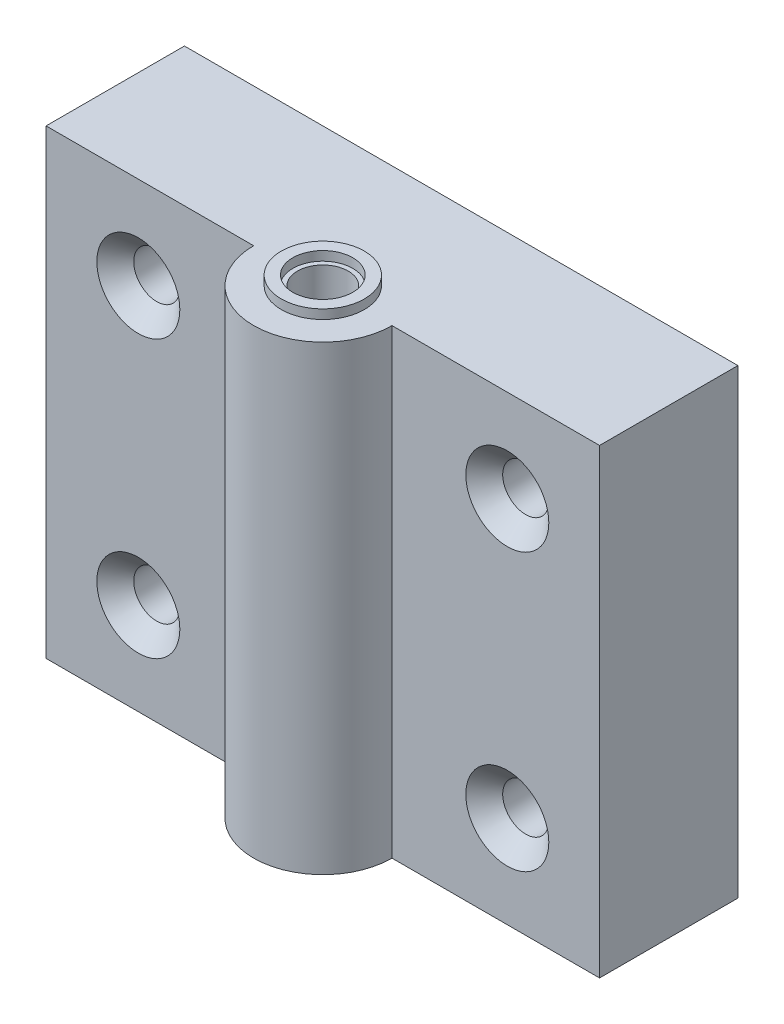
ISO-10303-21;
HEADER;
FILE_DESCRIPTION(('STEP AP214'),'2;1');
FILE_NAME('part.step','',(''),(''),'','','');
FILE_SCHEMA(('AUTOMOTIVE_DESIGN { 1 0 10303 214 1 1 1 1 }'));
ENDSEC;
DATA;
#1=APPLICATION_CONTEXT('core data for automotive mechanical design processes');
#2=APPLICATION_PROTOCOL_DEFINITION('international standard','automotive_design',2000,#1);
#3=PRODUCT_CONTEXT('',#1,'mechanical');
#4=PRODUCT('Part','Part','',(#3));
#5=PRODUCT_RELATED_PRODUCT_CATEGORY('part','',(#4));
#6=PRODUCT_DEFINITION_FORMATION('','',#4);
#7=PRODUCT_DEFINITION_CONTEXT('part definition',#1,'design');
#8=PRODUCT_DEFINITION('design','',#6,#7);
#9=PRODUCT_DEFINITION_SHAPE('','',#8);
#10=(LENGTH_UNIT() NAMED_UNIT(*) SI_UNIT(.MILLI.,.METRE.));
#11=(NAMED_UNIT(*) PLANE_ANGLE_UNIT() SI_UNIT($,.RADIAN.));
#12=(NAMED_UNIT(*) SI_UNIT($,.STERADIAN.) SOLID_ANGLE_UNIT());
#13=UNCERTAINTY_MEASURE_WITH_UNIT(LENGTH_MEASURE(1.E-05),#10,'distance_accuracy_value','');
#14=(GEOMETRIC_REPRESENTATION_CONTEXT(3) GLOBAL_UNCERTAINTY_ASSIGNED_CONTEXT((#13)) GLOBAL_UNIT_ASSIGNED_CONTEXT((#10,
#11,#12)) REPRESENTATION_CONTEXT('',''));
#15=CARTESIAN_POINT('',(0.,0.,0.));
#16=DIRECTION('',(0.,0.,1.));
#17=DIRECTION('',(1.,0.,0.));
#18=AXIS2_PLACEMENT_3D('',#15,#16,#17);
#19=CARTESIAN_POINT('',(0.,0.,15.));
#20=DIRECTION('',(0.,0.,1.));
#21=DIRECTION('',(1.,0.,0.));
#22=AXIS2_PLACEMENT_3D('',#19,#20,#21);
#23=PLANE('',#22);
#24=CARTESIAN_POINT('',(20.,15.,15.));
#25=DIRECTION('',(0.,0.,1.));
#26=DIRECTION('',(1.,0.,0.));
#27=AXIS2_PLACEMENT_3D('',#24,#25,#26);
#28=CIRCLE('',#27,4.5);
#29=CARTESIAN_POINT('',(24.5,15.,15.));
#30=VERTEX_POINT('',#29);
#31=EDGE_CURVE('E375',#30,#30,#28,.T.);
#32=ORIENTED_EDGE('',*,*,#31,.F.);
#33=EDGE_LOOP('',(#32));
#34=FACE_BOUND('',#33,.T.);
#35=CARTESIAN_POINT('',(20.,-15.,15.));
#36=DIRECTION('',(0.,0.,1.));
#37=DIRECTION('',(1.,0.,0.));
#38=AXIS2_PLACEMENT_3D('',#35,#36,#37);
#39=CIRCLE('',#38,4.5);
#40=CARTESIAN_POINT('',(24.5,-15.,15.));
#41=VERTEX_POINT('',#40);
#42=EDGE_CURVE('E377',#41,#41,#39,.T.);
#43=ORIENTED_EDGE('',*,*,#42,.F.);
#44=EDGE_LOOP('',(#43));
#45=FACE_BOUND('',#44,.T.);
#46=DIRECTION('',(0.,1.,0.));
#47=VECTOR('',#46,1.);
#48=CARTESIAN_POINT('',(7.5,-25.,15.));
#49=LINE('',#48,#47);
#50=CARTESIAN_POINT('',(7.5,-25.,15.));
#51=VERTEX_POINT('',#50);
#52=CARTESIAN_POINT('',(7.5,25.,15.));
#53=VERTEX_POINT('',#52);
#54=EDGE_CURVE('E50',#51,#53,#49,.T.);
#55=ORIENTED_EDGE('',*,*,#54,.F.);
#56=DIRECTION('',(1.,0.,0.));
#57=VECTOR('',#56,1.);
#58=CARTESIAN_POINT('',(-30.,-25.,15.));
#59=LINE('',#58,#57);
#60=CARTESIAN_POINT('',(30.,-25.,15.));
#61=VERTEX_POINT('',#60);
#62=EDGE_CURVE('E121',#51,#61,#59,.T.);
#63=ORIENTED_EDGE('',*,*,#62,.T.);
#64=DIRECTION('',(0.,1.,0.));
#65=VECTOR('',#64,1.);
#66=CARTESIAN_POINT('',(30.,25.,15.));
#67=LINE('',#66,#65);
#68=CARTESIAN_POINT('',(30.,25.,15.));
#69=VERTEX_POINT('',#68);
#70=EDGE_CURVE('E97',#61,#69,#67,.T.);
#71=ORIENTED_EDGE('',*,*,#70,.T.);
#72=DIRECTION('',(-1.,0.,0.));
#73=VECTOR('',#72,1.);
#74=CARTESIAN_POINT('',(-30.,25.,15.));
#75=LINE('',#74,#73);
#76=EDGE_CURVE('E96',#69,#53,#75,.T.);
#77=ORIENTED_EDGE('',*,*,#76,.T.);
#78=EDGE_LOOP('',(#55,#63,#71,#77));
#79=FACE_BOUND('',#78,.T.);
#80=ADVANCED_FACE('F35',(#34,#45,#79),#23,.T.);
#81=CARTESIAN_POINT('',(30.,25.,15.));
#82=DIRECTION('',(-1.,0.,0.));
#83=DIRECTION('',(0.,-1.,0.));
#84=AXIS2_PLACEMENT_3D('',#81,#82,#83);
#85=PLANE('',#84);
#86=DIRECTION('',(0.,1.,0.));
#87=VECTOR('',#86,1.);
#88=CARTESIAN_POINT('',(30.,25.,0.));
#89=LINE('',#88,#87);
#90=CARTESIAN_POINT('',(30.,-25.,0.));
#91=VERTEX_POINT('',#90);
#92=CARTESIAN_POINT('',(30.,25.,0.));
#93=VERTEX_POINT('',#92);
#94=EDGE_CURVE('E104',#91,#93,#89,.T.);
#95=ORIENTED_EDGE('',*,*,#94,.T.);
#96=DIRECTION('',(0.,0.,-1.));
#97=VECTOR('',#96,1.);
#98=CARTESIAN_POINT('',(30.,25.,15.));
#99=LINE('',#98,#97);
#100=EDGE_CURVE('E43',#69,#93,#99,.T.);
#101=ORIENTED_EDGE('',*,*,#100,.F.);
#102=ORIENTED_EDGE('',*,*,#70,.F.);
#103=DIRECTION('',(0.,0.,-1.));
#104=VECTOR('',#103,1.);
#105=CARTESIAN_POINT('',(30.,-25.,15.));
#106=LINE('',#105,#104);
#107=EDGE_CURVE('E123',#61,#91,#106,.T.);
#108=ORIENTED_EDGE('',*,*,#107,.T.);
#109=EDGE_LOOP('',(#95,#101,#102,#108));
#110=FACE_BOUND('',#109,.T.);
#111=ADVANCED_FACE('F37',(#110),#85,.F.);
#112=CARTESIAN_POINT('',(-30.,25.,15.));
#113=DIRECTION('',(0.,-1.,0.));
#114=DIRECTION('',(0.,0.,-1.));
#115=AXIS2_PLACEMENT_3D('',#112,#113,#114);
#116=PLANE('',#115);
#117=CARTESIAN_POINT('',(0.,25.,15.));
#118=DIRECTION('',(0.,-1.,0.));
#119=DIRECTION('',(0.,0.,-1.));
#120=AXIS2_PLACEMENT_3D('',#117,#118,#119);
#121=CIRCLE('',#120,4.5);
#122=CARTESIAN_POINT('',(0.,25.,10.5));
#123=VERTEX_POINT('',#122);
#124=EDGE_CURVE('E11',#123,#123,#121,.F.);
#125=ORIENTED_EDGE('',*,*,#124,.F.);
#126=EDGE_LOOP('',(#125));
#127=FACE_BOUND('',#126,.T.);
#128=DIRECTION('',(-1.,0.,0.));
#129=VECTOR('',#128,1.);
#130=CARTESIAN_POINT('',(-30.,25.,0.));
#131=LINE('',#130,#129);
#132=CARTESIAN_POINT('',(-30.,25.,0.));
#133=VERTEX_POINT('',#132);
#134=EDGE_CURVE('E126',#93,#133,#131,.T.);
#135=ORIENTED_EDGE('',*,*,#134,.T.);
#136=DIRECTION('',(0.,0.,-1.));
#137=VECTOR('',#136,1.);
#138=CARTESIAN_POINT('',(-30.,25.,15.));
#139=LINE('',#138,#137);
#140=CARTESIAN_POINT('',(-30.,25.,15.));
#141=VERTEX_POINT('',#140);
#142=EDGE_CURVE('E94',#141,#133,#139,.T.);
#143=ORIENTED_EDGE('',*,*,#142,.F.);
#144=CARTESIAN_POINT('',(-7.5,25.,15.));
#145=VERTEX_POINT('',#144);
#146=EDGE_CURVE('E89',#145,#141,#75,.T.);
#147=ORIENTED_EDGE('',*,*,#146,.F.);
#148=CARTESIAN_POINT('',(0.,25.,15.));
#149=DIRECTION('',(0.,1.,0.));
#150=DIRECTION('',(0.,0.,1.));
#151=AXIS2_PLACEMENT_3D('',#148,#149,#150);
#152=CIRCLE('',#151,7.5);
#153=EDGE_CURVE('E92',#145,#53,#152,.T.);
#154=ORIENTED_EDGE('',*,*,#153,.T.);
#155=ORIENTED_EDGE('',*,*,#76,.F.);
#156=ORIENTED_EDGE('',*,*,#100,.T.);
#157=EDGE_LOOP('',(#135,#143,#147,#154,#155,#156));
#158=FACE_BOUND('',#157,.T.);
#159=ADVANCED_FACE('F90',(#127,#158),#116,.F.);
#160=CARTESIAN_POINT('',(-30.,25.,15.));
#161=DIRECTION('',(1.,0.,0.));
#162=DIRECTION('',(0.,1.,0.));
#163=AXIS2_PLACEMENT_3D('',#160,#161,#162);
#164=PLANE('',#163);
#165=DIRECTION('',(0.,-1.,0.));
#166=VECTOR('',#165,1.);
#167=CARTESIAN_POINT('',(-30.,25.,0.));
#168=LINE('',#167,#166);
#169=CARTESIAN_POINT('',(-30.,-25.,0.));
#170=VERTEX_POINT('',#169);
#171=EDGE_CURVE('E128',#133,#170,#168,.T.);
#172=ORIENTED_EDGE('',*,*,#171,.T.);
#173=DIRECTION('',(0.,0.,-1.));
#174=VECTOR('',#173,1.);
#175=CARTESIAN_POINT('',(-30.,-25.,15.));
#176=LINE('',#175,#174);
#177=CARTESIAN_POINT('',(-30.,-25.,15.));
#178=VERTEX_POINT('',#177);
#179=EDGE_CURVE('E133',#178,#170,#176,.T.);
#180=ORIENTED_EDGE('',*,*,#179,.F.);
#181=DIRECTION('',(0.,-1.,0.));
#182=VECTOR('',#181,1.);
#183=CARTESIAN_POINT('',(-30.,25.,15.));
#184=LINE('',#183,#182);
#185=EDGE_CURVE('E119',#141,#178,#184,.T.);
#186=ORIENTED_EDGE('',*,*,#185,.F.);
#187=ORIENTED_EDGE('',*,*,#142,.T.);
#188=EDGE_LOOP('',(#172,#180,#186,#187));
#189=FACE_BOUND('',#188,.T.);
#190=ADVANCED_FACE('F148',(#189),#164,.F.);
#191=CARTESIAN_POINT('',(-30.,-25.,15.));
#192=DIRECTION('',(0.,1.,0.));
#193=DIRECTION('',(0.,0.,1.));
#194=AXIS2_PLACEMENT_3D('',#191,#192,#193);
#195=PLANE('',#194);
#196=CARTESIAN_POINT('',(0.,-25.,15.));
#197=DIRECTION('',(0.,1.,0.));
#198=DIRECTION('',(0.,0.,1.));
#199=AXIS2_PLACEMENT_3D('',#196,#197,#198);
#200=CIRCLE('',#199,2.75);
#201=CARTESIAN_POINT('',(0.,-25.,17.75));
#202=VERTEX_POINT('',#201);
#203=EDGE_CURVE('E200',#202,#202,#200,.T.);
#204=ORIENTED_EDGE('',*,*,#203,.T.);
#205=EDGE_LOOP('',(#204));
#206=FACE_BOUND('',#205,.T.);
#207=DIRECTION('',(1.,0.,0.));
#208=VECTOR('',#207,1.);
#209=CARTESIAN_POINT('',(-30.,-25.,0.));
#210=LINE('',#209,#208);
#211=EDGE_CURVE('E117',#170,#91,#210,.T.);
#212=ORIENTED_EDGE('',*,*,#211,.T.);
#213=ORIENTED_EDGE('',*,*,#107,.F.);
#214=ORIENTED_EDGE('',*,*,#62,.F.);
#215=CARTESIAN_POINT('',(0.,-25.,15.));
#216=DIRECTION('',(0.,1.,0.));
#217=DIRECTION('',(0.,0.,1.));
#218=AXIS2_PLACEMENT_3D('',#215,#216,#217);
#219=CIRCLE('',#218,7.5);
#220=CARTESIAN_POINT('',(-7.5,-25.,15.));
#221=VERTEX_POINT('',#220);
#222=EDGE_CURVE('E107',#221,#51,#219,.T.);
#223=ORIENTED_EDGE('',*,*,#222,.F.);
#224=EDGE_CURVE('E58',#178,#221,#59,.T.);
#225=ORIENTED_EDGE('',*,*,#224,.F.);
#226=ORIENTED_EDGE('',*,*,#179,.T.);
#227=EDGE_LOOP('',(#212,#213,#214,#223,#225,#226));
#228=FACE_BOUND('',#227,.T.);
#229=ADVANCED_FACE('F150',(#206,#228),#195,.F.);
#230=CARTESIAN_POINT('',(-20.,15.,15.));
#231=DIRECTION('',(0.,0.,1.));
#232=DIRECTION('',(1.,0.,0.));
#233=AXIS2_PLACEMENT_3D('',#230,#231,#232);
#234=CIRCLE('',#233,4.5);
#235=CARTESIAN_POINT('',(-15.5,15.,15.));
#236=VERTEX_POINT('',#235);
#237=EDGE_CURVE('E173',#236,#236,#234,.T.);
#238=ORIENTED_EDGE('',*,*,#237,.F.);
#239=EDGE_LOOP('',(#238));
#240=FACE_BOUND('',#239,.T.);
#241=CARTESIAN_POINT('',(-20.,-15.,15.));
#242=DIRECTION('',(0.,0.,1.));
#243=DIRECTION('',(1.,0.,0.));
#244=AXIS2_PLACEMENT_3D('',#241,#242,#243);
#245=CIRCLE('',#244,4.5);
#246=CARTESIAN_POINT('',(-15.5,-15.,15.));
#247=VERTEX_POINT('',#246);
#248=EDGE_CURVE('E176',#247,#247,#245,.T.);
#249=ORIENTED_EDGE('',*,*,#248,.F.);
#250=EDGE_LOOP('',(#249));
#251=FACE_BOUND('',#250,.T.);
#252=DIRECTION('',(0.,1.,0.));
#253=VECTOR('',#252,1.);
#254=CARTESIAN_POINT('',(-7.5,-25.,15.));
#255=LINE('',#254,#253);
#256=EDGE_CURVE('E99',#221,#145,#255,.T.);
#257=ORIENTED_EDGE('',*,*,#256,.T.);
#258=ORIENTED_EDGE('',*,*,#146,.T.);
#259=ORIENTED_EDGE('',*,*,#185,.T.);
#260=ORIENTED_EDGE('',*,*,#224,.T.);
#261=EDGE_LOOP('',(#257,#258,#259,#260));
#262=FACE_BOUND('',#261,.T.);
#263=ADVANCED_FACE('F100',(#240,#251,#262),#23,.T.);
#264=CARTESIAN_POINT('',(0.,0.,0.));
#265=DIRECTION('',(0.,0.,1.));
#266=DIRECTION('',(1.,0.,0.));
#267=AXIS2_PLACEMENT_3D('',#264,#265,#266);
#268=PLANE('',#267);
#269=CARTESIAN_POINT('',(-20.,15.,0.));
#270=DIRECTION('',(0.,0.,1.));
#271=DIRECTION('',(-1.,0.,0.));
#272=AXIS2_PLACEMENT_3D('',#269,#270,#271);
#273=CIRCLE('',#272,2.5);
#274=CARTESIAN_POINT('',(-22.5,15.,0.));
#275=VERTEX_POINT('',#274);
#276=EDGE_CURVE('E191',#275,#275,#273,.T.);
#277=ORIENTED_EDGE('',*,*,#276,.T.);
#278=EDGE_LOOP('',(#277));
#279=FACE_BOUND('',#278,.T.);
#280=CARTESIAN_POINT('',(20.,-15.,0.));
#281=DIRECTION('',(0.,0.,1.));
#282=DIRECTION('',(-1.,0.,0.));
#283=AXIS2_PLACEMENT_3D('',#280,#281,#282);
#284=CIRCLE('',#283,2.5);
#285=CARTESIAN_POINT('',(17.5,-15.,0.));
#286=VERTEX_POINT('',#285);
#287=EDGE_CURVE('E190',#286,#286,#284,.T.);
#288=ORIENTED_EDGE('',*,*,#287,.T.);
#289=EDGE_LOOP('',(#288));
#290=FACE_BOUND('',#289,.T.);
#291=CARTESIAN_POINT('',(20.,15.,0.));
#292=DIRECTION('',(0.,0.,1.));
#293=DIRECTION('',(1.,0.,0.));
#294=AXIS2_PLACEMENT_3D('',#291,#292,#293);
#295=CIRCLE('',#294,2.5);
#296=CARTESIAN_POINT('',(22.5,15.,0.));
#297=VERTEX_POINT('',#296);
#298=EDGE_CURVE('E182',#297,#297,#295,.T.);
#299=ORIENTED_EDGE('',*,*,#298,.T.);
#300=EDGE_LOOP('',(#299));
#301=FACE_BOUND('',#300,.T.);
#302=CARTESIAN_POINT('',(-20.,-15.,0.));
#303=DIRECTION('',(0.,0.,1.));
#304=DIRECTION('',(1.,0.,0.));
#305=AXIS2_PLACEMENT_3D('',#302,#303,#304);
#306=CIRCLE('',#305,2.5);
#307=CARTESIAN_POINT('',(-17.5,-15.,0.));
#308=VERTEX_POINT('',#307);
#309=EDGE_CURVE('E194',#308,#308,#306,.T.);
#310=ORIENTED_EDGE('',*,*,#309,.T.);
#311=EDGE_LOOP('',(#310));
#312=FACE_BOUND('',#311,.T.);
#313=ORIENTED_EDGE('',*,*,#94,.F.);
#314=ORIENTED_EDGE('',*,*,#211,.F.);
#315=ORIENTED_EDGE('',*,*,#171,.F.);
#316=ORIENTED_EDGE('',*,*,#134,.F.);
#317=EDGE_LOOP('',(#313,#314,#315,#316));
#318=FACE_BOUND('',#317,.T.);
#319=ADVANCED_FACE('F144',(#279,#290,#301,#312,#318),#268,.F.);
#320=CARTESIAN_POINT('',(0.,-25.,15.));
#321=DIRECTION('',(0.,1.,0.));
#322=DIRECTION('',(0.,0.,1.));
#323=AXIS2_PLACEMENT_3D('',#320,#321,#322);
#324=CYLINDRICAL_SURFACE('',#323,7.5);
#325=ORIENTED_EDGE('',*,*,#153,.F.);
#326=ORIENTED_EDGE('',*,*,#256,.F.);
#327=ORIENTED_EDGE('',*,*,#222,.T.);
#328=ORIENTED_EDGE('',*,*,#54,.T.);
#329=EDGE_LOOP('',(#325,#326,#327,#328));
#330=FACE_BOUND('',#329,.T.);
#331=ADVANCED_FACE('F106',(#330),#324,.T.);
#332=CARTESIAN_POINT('',(0.,26.,15.));
#333=DIRECTION('',(0.,1.,0.));
#334=DIRECTION('',(0.,0.,1.));
#335=AXIS2_PLACEMENT_3D('',#332,#333,#334);
#336=PLANE('',#335);
#337=CARTESIAN_POINT('',(0.,26.,15.));
#338=DIRECTION('',(0.,1.,0.));
#339=DIRECTION('',(0.,0.,1.));
#340=AXIS2_PLACEMENT_3D('',#337,#338,#339);
#341=CIRCLE('',#340,4.5);
#342=CARTESIAN_POINT('',(0.,26.,19.5));
#343=VERTEX_POINT('',#342);
#344=EDGE_CURVE('E108',#343,#343,#341,.T.);
#345=ORIENTED_EDGE('',*,*,#344,.T.);
#346=EDGE_LOOP('',(#345));
#347=FACE_BOUND('',#346,.T.);
#348=CARTESIAN_POINT('',(0.,26.,15.));
#349=DIRECTION('',(0.,1.,0.));
#350=DIRECTION('',(0.,0.,1.));
#351=AXIS2_PLACEMENT_3D('',#348,#349,#350);
#352=CIRCLE('',#351,3.25);
#353=CARTESIAN_POINT('',(0.,26.,18.25));
#354=VERTEX_POINT('',#353);
#355=EDGE_CURVE('E112',#354,#354,#352,.T.);
#356=ORIENTED_EDGE('',*,*,#355,.F.);
#357=EDGE_LOOP('',(#356));
#358=FACE_BOUND('',#357,.T.);
#359=ADVANCED_FACE('F224',(#347,#358),#336,.T.);
#360=CARTESIAN_POINT('',(0.,26.,15.));
#361=DIRECTION('',(0.,-1.,0.));
#362=DIRECTION('',(0.,0.,-1.));
#363=AXIS2_PLACEMENT_3D('',#360,#361,#362);
#364=CYLINDRICAL_SURFACE('',#363,4.5);
#365=ORIENTED_EDGE('',*,*,#344,.F.);
#366=EDGE_LOOP('',(#365));
#367=FACE_BOUND('',#366,.T.);
#368=ORIENTED_EDGE('',*,*,#124,.T.);
#369=EDGE_LOOP('',(#368));
#370=FACE_BOUND('',#369,.T.);
#371=ADVANCED_FACE('F215',(#367,#370),#364,.T.);
#372=CARTESIAN_POINT('',(0.,26.,15.));
#373=DIRECTION('',(0.,-1.,0.));
#374=DIRECTION('',(0.,0.,-1.));
#375=AXIS2_PLACEMENT_3D('',#372,#373,#374);
#376=CYLINDRICAL_SURFACE('',#375,3.25);
#377=ORIENTED_EDGE('',*,*,#355,.T.);
#378=EDGE_LOOP('',(#377));
#379=FACE_BOUND('',#378,.T.);
#380=CARTESIAN_POINT('',(0.,25.,15.));
#381=DIRECTION('',(0.,1.,0.));
#382=DIRECTION('',(0.,0.,1.));
#383=AXIS2_PLACEMENT_3D('',#380,#381,#382);
#384=CIRCLE('',#383,3.25);
#385=CARTESIAN_POINT('',(0.,25.,18.25));
#386=VERTEX_POINT('',#385);
#387=EDGE_CURVE('E203',#386,#386,#384,.T.);
#388=ORIENTED_EDGE('',*,*,#387,.F.);
#389=EDGE_LOOP('',(#388));
#390=FACE_BOUND('',#389,.T.);
#391=ADVANCED_FACE('F213',(#379,#390),#376,.F.);
#392=CARTESIAN_POINT('',(0.,25.,15.));
#393=DIRECTION('',(0.,1.,0.));
#394=DIRECTION('',(0.,0.,1.));
#395=AXIS2_PLACEMENT_3D('',#392,#393,#394);
#396=CIRCLE('',#395,2.75);
#397=CARTESIAN_POINT('',(0.,25.,17.75));
#398=VERTEX_POINT('',#397);
#399=EDGE_CURVE('E199',#398,#398,#396,.T.);
#400=ORIENTED_EDGE('',*,*,#399,.F.);
#401=EDGE_LOOP('',(#400));
#402=FACE_BOUND('',#401,.T.);
#403=ORIENTED_EDGE('',*,*,#387,.T.);
#404=EDGE_LOOP('',(#403));
#405=FACE_BOUND('',#404,.T.);
#406=ADVANCED_FACE('F211',(#402,#405),#116,.F.);
#407=CARTESIAN_POINT('',(0.,-25.,15.));
#408=DIRECTION('',(0.,1.,0.));
#409=DIRECTION('',(0.,0.,1.));
#410=AXIS2_PLACEMENT_3D('',#407,#408,#409);
#411=CYLINDRICAL_SURFACE('',#410,2.75);
#412=ORIENTED_EDGE('',*,*,#203,.F.);
#413=EDGE_LOOP('',(#412));
#414=FACE_BOUND('',#413,.T.);
#415=ORIENTED_EDGE('',*,*,#399,.T.);
#416=EDGE_LOOP('',(#415));
#417=FACE_BOUND('',#416,.T.);
#418=ADVANCED_FACE('F222',(#414,#417),#411,.F.);
#419=CARTESIAN_POINT('',(-20.,-15.,0.));
#420=DIRECTION('',(0.,0.,1.));
#421=DIRECTION('',(1.,0.,0.));
#422=AXIS2_PLACEMENT_3D('',#419,#420,#421);
#423=CYLINDRICAL_SURFACE('',#422,2.5);
#424=CARTESIAN_POINT('',(-20.,-15.,13.));
#425=DIRECTION('',(0.,0.,1.));
#426=DIRECTION('',(1.,0.,0.));
#427=AXIS2_PLACEMENT_3D('',#424,#425,#426);
#428=CIRCLE('',#427,2.5);
#429=CARTESIAN_POINT('',(-17.5,-15.,13.));
#430=VERTEX_POINT('',#429);
#431=EDGE_CURVE('E178',#430,#430,#428,.T.);
#432=ORIENTED_EDGE('',*,*,#431,.T.);
#433=EDGE_LOOP('',(#432));
#434=FACE_BOUND('',#433,.T.);
#435=ORIENTED_EDGE('',*,*,#309,.F.);
#436=EDGE_LOOP('',(#435));
#437=FACE_BOUND('',#436,.T.);
#438=ADVANCED_FACE('F275',(#434,#437),#423,.F.);
#439=CARTESIAN_POINT('',(20.,15.,0.));
#440=DIRECTION('',(0.,0.,1.));
#441=DIRECTION('',(1.,0.,0.));
#442=AXIS2_PLACEMENT_3D('',#439,#440,#441);
#443=CYLINDRICAL_SURFACE('',#442,2.5);
#444=CARTESIAN_POINT('',(20.,15.,13.));
#445=DIRECTION('',(0.,0.,1.));
#446=DIRECTION('',(1.,0.,0.));
#447=AXIS2_PLACEMENT_3D('',#444,#445,#446);
#448=CIRCLE('',#447,2.5);
#449=CARTESIAN_POINT('',(22.5,15.,13.));
#450=VERTEX_POINT('',#449);
#451=EDGE_CURVE('E373',#450,#450,#448,.T.);
#452=ORIENTED_EDGE('',*,*,#451,.T.);
#453=EDGE_LOOP('',(#452));
#454=FACE_BOUND('',#453,.T.);
#455=ORIENTED_EDGE('',*,*,#298,.F.);
#456=EDGE_LOOP('',(#455));
#457=FACE_BOUND('',#456,.T.);
#458=ADVANCED_FACE('F291',(#454,#457),#443,.F.);
#459=CARTESIAN_POINT('',(20.,-15.,0.));
#460=DIRECTION('',(0.,0.,1.));
#461=DIRECTION('',(1.,0.,0.));
#462=AXIS2_PLACEMENT_3D('',#459,#460,#461);
#463=CYLINDRICAL_SURFACE('',#462,2.5);
#464=CARTESIAN_POINT('',(20.,-15.,13.));
#465=DIRECTION('',(0.,0.,1.));
#466=DIRECTION('',(1.,0.,0.));
#467=AXIS2_PLACEMENT_3D('',#464,#465,#466);
#468=CIRCLE('',#467,2.5);
#469=CARTESIAN_POINT('',(22.5,-15.,13.));
#470=VERTEX_POINT('',#469);
#471=EDGE_CURVE('E382',#470,#470,#468,.T.);
#472=ORIENTED_EDGE('',*,*,#471,.T.);
#473=EDGE_LOOP('',(#472));
#474=FACE_BOUND('',#473,.T.);
#475=ORIENTED_EDGE('',*,*,#287,.F.);
#476=EDGE_LOOP('',(#475));
#477=FACE_BOUND('',#476,.T.);
#478=ADVANCED_FACE('F319',(#474,#477),#463,.F.);
#479=CARTESIAN_POINT('',(-20.,15.,0.));
#480=DIRECTION('',(0.,0.,1.));
#481=DIRECTION('',(1.,0.,0.));
#482=AXIS2_PLACEMENT_3D('',#479,#480,#481);
#483=CYLINDRICAL_SURFACE('',#482,2.5);
#484=CARTESIAN_POINT('',(-20.,15.,13.));
#485=DIRECTION('',(0.,0.,1.));
#486=DIRECTION('',(1.,0.,0.));
#487=AXIS2_PLACEMENT_3D('',#484,#485,#486);
#488=CIRCLE('',#487,2.5);
#489=CARTESIAN_POINT('',(-17.5,15.,13.));
#490=VERTEX_POINT('',#489);
#491=EDGE_CURVE('E179',#490,#490,#488,.T.);
#492=ORIENTED_EDGE('',*,*,#491,.T.);
#493=EDGE_LOOP('',(#492));
#494=FACE_BOUND('',#493,.T.);
#495=ORIENTED_EDGE('',*,*,#276,.F.);
#496=EDGE_LOOP('',(#495));
#497=FACE_BOUND('',#496,.T.);
#498=ADVANCED_FACE('F303',(#494,#497),#483,.F.);
#499=CARTESIAN_POINT('',(-20.,-15.,15.));
#500=DIRECTION('',(0.,0.,1.));
#501=DIRECTION('',(1.,0.,0.));
#502=AXIS2_PLACEMENT_3D('',#499,#500,#501);
#503=CONICAL_SURFACE('',#502,4.5,0.785398163397453);
#504=ORIENTED_EDGE('',*,*,#431,.F.);
#505=EDGE_LOOP('',(#504));
#506=FACE_BOUND('',#505,.T.);
#507=ORIENTED_EDGE('',*,*,#248,.T.);
#508=EDGE_LOOP('',(#507));
#509=FACE_BOUND('',#508,.T.);
#510=ADVANCED_FACE('F298',(#506,#509),#503,.F.);
#511=CARTESIAN_POINT('',(-20.,15.,15.));
#512=DIRECTION('',(0.,0.,1.));
#513=DIRECTION('',(1.,0.,0.));
#514=AXIS2_PLACEMENT_3D('',#511,#512,#513);
#515=CONICAL_SURFACE('',#514,4.5,0.785398163397453);
#516=ORIENTED_EDGE('',*,*,#491,.F.);
#517=EDGE_LOOP('',(#516));
#518=FACE_BOUND('',#517,.T.);
#519=ORIENTED_EDGE('',*,*,#237,.T.);
#520=EDGE_LOOP('',(#519));
#521=FACE_BOUND('',#520,.T.);
#522=ADVANCED_FACE('F302',(#518,#521),#515,.F.);
#523=CARTESIAN_POINT('',(20.,-15.,15.));
#524=DIRECTION('',(0.,0.,1.));
#525=DIRECTION('',(1.,0.,0.));
#526=AXIS2_PLACEMENT_3D('',#523,#524,#525);
#527=CONICAL_SURFACE('',#526,4.5,0.785398163397453);
#528=ORIENTED_EDGE('',*,*,#471,.F.);
#529=EDGE_LOOP('',(#528));
#530=FACE_BOUND('',#529,.T.);
#531=ORIENTED_EDGE('',*,*,#42,.T.);
#532=EDGE_LOOP('',(#531));
#533=FACE_BOUND('',#532,.T.);
#534=ADVANCED_FACE('F328',(#530,#533),#527,.F.);
#535=CARTESIAN_POINT('',(20.,15.,15.));
#536=DIRECTION('',(0.,0.,1.));
#537=DIRECTION('',(1.,0.,0.));
#538=AXIS2_PLACEMENT_3D('',#535,#536,#537);
#539=CONICAL_SURFACE('',#538,4.5,0.785398163397453);
#540=ORIENTED_EDGE('',*,*,#451,.F.);
#541=EDGE_LOOP('',(#540));
#542=FACE_BOUND('',#541,.T.);
#543=ORIENTED_EDGE('',*,*,#31,.T.);
#544=EDGE_LOOP('',(#543));
#545=FACE_BOUND('',#544,.T.);
#546=ADVANCED_FACE('F356',(#542,#545),#539,.F.);
#547=CLOSED_SHELL('',(#80,#111,#159,#190,#229,#263,#319,#331,#359,#371,#391,#406,#418,#438,#458,
#478,#498,#510,#522,#534,#546));
#548=MANIFOLD_SOLID_BREP('B2',#547);
#549=ADVANCED_BREP_SHAPE_REPRESENTATION('',(#18,#548),#14);
#550=SHAPE_DEFINITION_REPRESENTATION(#9,#549);
ENDSEC;
END-ISO-10303-21;
